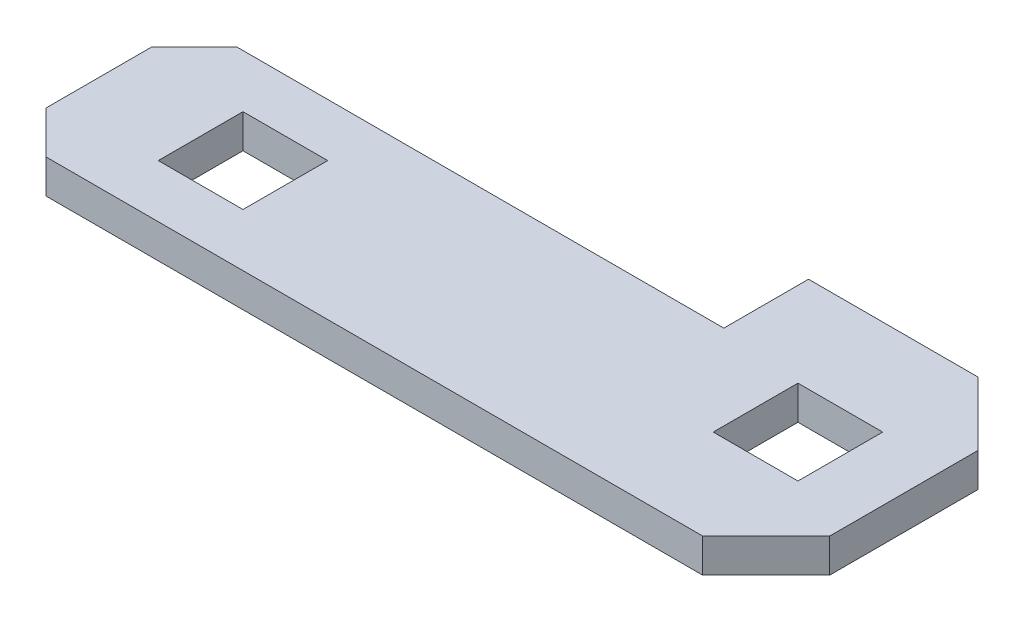
ISO-10303-21;
HEADER;
FILE_DESCRIPTION(('STEP AP214'),'2;1');
FILE_NAME('part.step','',(''),(''),'','','');
FILE_SCHEMA(('AUTOMOTIVE_DESIGN { 1 0 10303 214 1 1 1 1 }'));
ENDSEC;
DATA;
#1=APPLICATION_CONTEXT('core data for automotive mechanical design processes');
#2=APPLICATION_PROTOCOL_DEFINITION('international standard','automotive_design',2000,#1);
#3=PRODUCT_CONTEXT('',#1,'mechanical');
#4=PRODUCT('Part','Part','',(#3));
#5=PRODUCT_RELATED_PRODUCT_CATEGORY('part','',(#4));
#6=PRODUCT_DEFINITION_FORMATION('','',#4);
#7=PRODUCT_DEFINITION_CONTEXT('part definition',#1,'design');
#8=PRODUCT_DEFINITION('design','',#6,#7);
#9=PRODUCT_DEFINITION_SHAPE('','',#8);
#10=(LENGTH_UNIT() NAMED_UNIT(*) SI_UNIT(.MILLI.,.METRE.));
#11=(NAMED_UNIT(*) PLANE_ANGLE_UNIT() SI_UNIT($,.RADIAN.));
#12=(NAMED_UNIT(*) SI_UNIT($,.STERADIAN.) SOLID_ANGLE_UNIT());
#13=UNCERTAINTY_MEASURE_WITH_UNIT(LENGTH_MEASURE(1.E-05),#10,'distance_accuracy_value','');
#14=(GEOMETRIC_REPRESENTATION_CONTEXT(3) GLOBAL_UNCERTAINTY_ASSIGNED_CONTEXT((#13)) GLOBAL_UNIT_ASSIGNED_CONTEXT((#10,
#11,#12)) REPRESENTATION_CONTEXT('',''));
#15=CARTESIAN_POINT('',(0.,0.,0.));
#16=DIRECTION('',(0.,0.,1.));
#17=DIRECTION('',(1.,0.,0.));
#18=AXIS2_PLACEMENT_3D('',#15,#16,#17);
#19=CARTESIAN_POINT('',(18.,-0.8,0.));
#20=DIRECTION('',(0.,0.,1.));
#21=DIRECTION('',(1.,0.,0.));
#22=AXIS2_PLACEMENT_3D('',#19,#20,#21);
#23=PLANE('',#22);
#24=DIRECTION('',(1.,0.,0.));
#25=VECTOR('',#24,1.);
#26=CARTESIAN_POINT('',(18.,-0.8,0.));
#27=LINE('',#26,#25);
#28=CARTESIAN_POINT('',(1.,-0.8,0.));
#29=VERTEX_POINT('',#28);
#30=CARTESIAN_POINT('',(16.5,-0.8,0.));
#31=VERTEX_POINT('',#30);
#32=EDGE_CURVE('E240',#29,#31,#27,.T.);
#33=ORIENTED_EDGE('',*,*,#32,.T.);
#34=DIRECTION('',(0.,1.,0.));
#35=VECTOR('',#34,1.);
#36=CARTESIAN_POINT('',(16.5,-0.8,0.));
#37=LINE('',#36,#35);
#38=CARTESIAN_POINT('',(16.5,0.,0.));
#39=VERTEX_POINT('',#38);
#40=EDGE_CURVE('E11',#31,#39,#37,.T.);
#41=ORIENTED_EDGE('',*,*,#40,.T.);
#42=DIRECTION('',(1.,0.,0.));
#43=VECTOR('',#42,1.);
#44=CARTESIAN_POINT('',(18.,0.,0.));
#45=LINE('',#44,#43);
#46=CARTESIAN_POINT('',(1.,0.,0.));
#47=VERTEX_POINT('',#46);
#48=EDGE_CURVE('E233',#47,#39,#45,.T.);
#49=ORIENTED_EDGE('',*,*,#48,.F.);
#50=DIRECTION('',(0.,-1.,0.));
#51=VECTOR('',#50,1.);
#52=CARTESIAN_POINT('',(1.,-0.8,0.));
#53=LINE('',#52,#51);
#54=EDGE_CURVE('E293',#47,#29,#53,.T.);
#55=ORIENTED_EDGE('',*,*,#54,.T.);
#56=EDGE_LOOP('',(#33,#41,#49,#55));
#57=FACE_BOUND('',#56,.T.);
#58=ADVANCED_FACE('F36',(#57),#23,.T.);
#59=CARTESIAN_POINT('',(0.,-0.8,0.));
#60=DIRECTION('',(-1.,0.,0.));
#61=DIRECTION('',(0.,0.,1.));
#62=AXIS2_PLACEMENT_3D('',#59,#60,#61);
#63=PLANE('',#62);
#64=DIRECTION('',(0.,0.,1.));
#65=VECTOR('',#64,1.);
#66=CARTESIAN_POINT('',(0.,0.,0.));
#67=LINE('',#66,#65);
#68=CARTESIAN_POINT('',(0.,0.,-3.5));
#69=VERTEX_POINT('',#68);
#70=CARTESIAN_POINT('',(0.,0.,-0.999999999999997));
#71=VERTEX_POINT('',#70);
#72=EDGE_CURVE('E243',#69,#71,#67,.T.);
#73=ORIENTED_EDGE('',*,*,#72,.F.);
#74=DIRECTION('',(0.,-1.,0.));
#75=VECTOR('',#74,1.);
#76=CARTESIAN_POINT('',(0.,-0.8,-3.5));
#77=LINE('',#76,#75);
#78=CARTESIAN_POINT('',(0.,-0.8,-3.5));
#79=VERTEX_POINT('',#78);
#80=EDGE_CURVE('E287',#69,#79,#77,.T.);
#81=ORIENTED_EDGE('',*,*,#80,.T.);
#82=DIRECTION('',(0.,0.,1.));
#83=VECTOR('',#82,1.);
#84=CARTESIAN_POINT('',(0.,-0.8,0.));
#85=LINE('',#84,#83);
#86=CARTESIAN_POINT('',(0.,-0.8,-0.999999999999997));
#87=VERTEX_POINT('',#86);
#88=EDGE_CURVE('E254',#79,#87,#85,.T.);
#89=ORIENTED_EDGE('',*,*,#88,.T.);
#90=DIRECTION('',(0.,1.,0.));
#91=VECTOR('',#90,1.);
#92=CARTESIAN_POINT('',(0.,-0.8,-0.999999999999997));
#93=LINE('',#92,#91);
#94=EDGE_CURVE('E284',#87,#71,#93,.T.);
#95=ORIENTED_EDGE('',*,*,#94,.T.);
#96=EDGE_LOOP('',(#73,#81,#89,#95));
#97=FACE_BOUND('',#96,.T.);
#98=ADVANCED_FACE('F333',(#97),#63,.T.);
#99=CARTESIAN_POINT('',(0.,-0.8,-4.5));
#100=DIRECTION('',(0.,0.,-1.));
#101=DIRECTION('',(-1.,0.,0.));
#102=AXIS2_PLACEMENT_3D('',#99,#100,#101);
#103=PLANE('',#102);
#104=DIRECTION('',(-1.,0.,0.));
#105=VECTOR('',#104,1.);
#106=CARTESIAN_POINT('',(0.,-0.8,-4.5));
#107=LINE('',#106,#105);
#108=CARTESIAN_POINT('',(12.5,-0.8,-4.5));
#109=VERTEX_POINT('',#108);
#110=CARTESIAN_POINT('',(0.999999999999999,-0.8,-4.5));
#111=VERTEX_POINT('',#110);
#112=EDGE_CURVE('E251',#109,#111,#107,.T.);
#113=ORIENTED_EDGE('',*,*,#112,.T.);
#114=DIRECTION('',(0.,1.,0.));
#115=VECTOR('',#114,1.);
#116=CARTESIAN_POINT('',(0.999999999999999,-0.8,-4.5));
#117=LINE('',#116,#115);
#118=CARTESIAN_POINT('',(0.999999999999999,0.,-4.5));
#119=VERTEX_POINT('',#118);
#120=EDGE_CURVE('E275',#111,#119,#117,.T.);
#121=ORIENTED_EDGE('',*,*,#120,.T.);
#122=DIRECTION('',(-1.,0.,0.));
#123=VECTOR('',#122,1.);
#124=CARTESIAN_POINT('',(0.,0.,-4.5));
#125=LINE('',#124,#123);
#126=CARTESIAN_POINT('',(12.5,0.,-4.5));
#127=VERTEX_POINT('',#126);
#128=EDGE_CURVE('E268',#127,#119,#125,.T.);
#129=ORIENTED_EDGE('',*,*,#128,.F.);
#130=DIRECTION('',(0.,1.,0.));
#131=VECTOR('',#130,1.);
#132=CARTESIAN_POINT('',(12.5,-0.8,-4.5));
#133=LINE('',#132,#131);
#134=EDGE_CURVE('E273',#109,#127,#133,.T.);
#135=ORIENTED_EDGE('',*,*,#134,.F.);
#136=EDGE_LOOP('',(#113,#121,#129,#135));
#137=FACE_BOUND('',#136,.T.);
#138=ADVANCED_FACE('F324',(#137),#103,.T.);
#139=CARTESIAN_POINT('',(12.5,-0.8,-4.5));
#140=DIRECTION('',(-1.,0.,0.));
#141=DIRECTION('',(0.,0.,1.));
#142=AXIS2_PLACEMENT_3D('',#139,#140,#141);
#143=PLANE('',#142);
#144=DIRECTION('',(0.,0.,1.));
#145=VECTOR('',#144,1.);
#146=CARTESIAN_POINT('',(12.5,0.,-4.5));
#147=LINE('',#146,#145);
#148=CARTESIAN_POINT('',(12.5,0.,-6.5));
#149=VERTEX_POINT('',#148);
#150=EDGE_CURVE('E265',#149,#127,#147,.T.);
#151=ORIENTED_EDGE('',*,*,#150,.F.);
#152=DIRECTION('',(0.,1.,0.));
#153=VECTOR('',#152,1.);
#154=CARTESIAN_POINT('',(12.5,-0.8,-6.5));
#155=LINE('',#154,#153);
#156=CARTESIAN_POINT('',(12.5,-0.8,-6.5));
#157=VERTEX_POINT('',#156);
#158=EDGE_CURVE('E257',#157,#149,#155,.T.);
#159=ORIENTED_EDGE('',*,*,#158,.F.);
#160=DIRECTION('',(0.,0.,1.));
#161=VECTOR('',#160,1.);
#162=CARTESIAN_POINT('',(12.5,-0.8,-4.5));
#163=LINE('',#162,#161);
#164=EDGE_CURVE('E248',#157,#109,#163,.T.);
#165=ORIENTED_EDGE('',*,*,#164,.T.);
#166=ORIENTED_EDGE('',*,*,#134,.T.);
#167=EDGE_LOOP('',(#151,#159,#165,#166));
#168=FACE_BOUND('',#167,.T.);
#169=ADVANCED_FACE('F320',(#168),#143,.T.);
#170=CARTESIAN_POINT('',(12.5,-0.8,-6.5));
#171=DIRECTION('',(0.,0.,-1.));
#172=DIRECTION('',(-1.,0.,0.));
#173=AXIS2_PLACEMENT_3D('',#170,#171,#172);
#174=PLANE('',#173);
#175=DIRECTION('',(-1.,0.,0.));
#176=VECTOR('',#175,1.);
#177=CARTESIAN_POINT('',(12.5,0.,-6.5));
#178=LINE('',#177,#176);
#179=CARTESIAN_POINT('',(16.5,0.,-6.5));
#180=VERTEX_POINT('',#179);
#181=EDGE_CURVE('E263',#180,#149,#178,.T.);
#182=ORIENTED_EDGE('',*,*,#181,.F.);
#183=DIRECTION('',(0.,-1.,0.));
#184=VECTOR('',#183,1.);
#185=CARTESIAN_POINT('',(16.5,-0.8,-6.5));
#186=LINE('',#185,#184);
#187=CARTESIAN_POINT('',(16.5,-0.8,-6.5));
#188=VERTEX_POINT('',#187);
#189=EDGE_CURVE('E59',#180,#188,#186,.T.);
#190=ORIENTED_EDGE('',*,*,#189,.T.);
#191=DIRECTION('',(-1.,0.,0.));
#192=VECTOR('',#191,1.);
#193=CARTESIAN_POINT('',(12.5,-0.8,-6.5));
#194=LINE('',#193,#192);
#195=EDGE_CURVE('E246',#188,#157,#194,.T.);
#196=ORIENTED_EDGE('',*,*,#195,.T.);
#197=ORIENTED_EDGE('',*,*,#158,.T.);
#198=EDGE_LOOP('',(#182,#190,#196,#197));
#199=FACE_BOUND('',#198,.T.);
#200=ADVANCED_FACE('F316',(#199),#174,.T.);
#201=CARTESIAN_POINT('',(18.,-0.8,-6.5));
#202=DIRECTION('',(1.,0.,0.));
#203=DIRECTION('',(0.,0.,-1.));
#204=AXIS2_PLACEMENT_3D('',#201,#202,#203);
#205=PLANE('',#204);
#206=DIRECTION('',(0.,0.,-1.));
#207=VECTOR('',#206,1.);
#208=CARTESIAN_POINT('',(18.,-0.8,-6.5));
#209=LINE('',#208,#207);
#210=CARTESIAN_POINT('',(18.,-0.8,-1.5));
#211=VERTEX_POINT('',#210);
#212=CARTESIAN_POINT('',(18.,-0.8,-5.));
#213=VERTEX_POINT('',#212);
#214=EDGE_CURVE('E242',#211,#213,#209,.T.);
#215=ORIENTED_EDGE('',*,*,#214,.T.);
#216=DIRECTION('',(0.,1.,0.));
#217=VECTOR('',#216,1.);
#218=CARTESIAN_POINT('',(18.,-0.8,-5.));
#219=LINE('',#218,#217);
#220=CARTESIAN_POINT('',(18.,0.,-5.));
#221=VERTEX_POINT('',#220);
#222=EDGE_CURVE('E297',#213,#221,#219,.T.);
#223=ORIENTED_EDGE('',*,*,#222,.T.);
#224=DIRECTION('',(0.,0.,-1.));
#225=VECTOR('',#224,1.);
#226=CARTESIAN_POINT('',(18.,0.,-6.5));
#227=LINE('',#226,#225);
#228=CARTESIAN_POINT('',(18.,0.,-1.5));
#229=VERTEX_POINT('',#228);
#230=EDGE_CURVE('E260',#229,#221,#227,.T.);
#231=ORIENTED_EDGE('',*,*,#230,.F.);
#232=DIRECTION('',(0.,-1.,0.));
#233=VECTOR('',#232,1.);
#234=CARTESIAN_POINT('',(18.,-0.8,-1.5));
#235=LINE('',#234,#233);
#236=EDGE_CURVE('E295',#229,#211,#235,.T.);
#237=ORIENTED_EDGE('',*,*,#236,.T.);
#238=EDGE_LOOP('',(#215,#223,#231,#237));
#239=FACE_BOUND('',#238,.T.);
#240=ADVANCED_FACE('F310',(#239),#205,.T.);
#241=CARTESIAN_POINT('',(0.,-0.8,0.));
#242=DIRECTION('',(0.,-1.,0.));
#243=DIRECTION('',(0.,0.,-1.));
#244=AXIS2_PLACEMENT_3D('',#241,#242,#243);
#245=PLANE('',#244);
#246=DIRECTION('',(0.,0.,-1.));
#247=VECTOR('',#246,1.);
#248=CARTESIAN_POINT('',(16.5,-0.8,-2.25));
#249=LINE('',#248,#247);
#250=CARTESIAN_POINT('',(16.5,-0.8,-2.25));
#251=VERTEX_POINT('',#250);
#252=CARTESIAN_POINT('',(16.5,-0.8,-4.25));
#253=VERTEX_POINT('',#252);
#254=EDGE_CURVE('E168',#251,#253,#249,.T.);
#255=ORIENTED_EDGE('',*,*,#254,.T.);
#256=DIRECTION('',(-1.,0.,0.));
#257=VECTOR('',#256,1.);
#258=CARTESIAN_POINT('',(14.5,-0.8,-4.25));
#259=LINE('',#258,#257);
#260=CARTESIAN_POINT('',(14.5,-0.8,-4.25));
#261=VERTEX_POINT('',#260);
#262=EDGE_CURVE('E180',#253,#261,#259,.T.);
#263=ORIENTED_EDGE('',*,*,#262,.T.);
#264=DIRECTION('',(0.,0.,1.));
#265=VECTOR('',#264,1.);
#266=CARTESIAN_POINT('',(14.5,-0.8,-2.25));
#267=LINE('',#266,#265);
#268=CARTESIAN_POINT('',(14.5,-0.8,-2.25));
#269=VERTEX_POINT('',#268);
#270=EDGE_CURVE('E184',#261,#269,#267,.T.);
#271=ORIENTED_EDGE('',*,*,#270,.T.);
#272=DIRECTION('',(1.,0.,0.));
#273=VECTOR('',#272,1.);
#274=CARTESIAN_POINT('',(14.5,-0.8,-2.25));
#275=LINE('',#274,#273);
#276=EDGE_CURVE('E176',#269,#251,#275,.T.);
#277=ORIENTED_EDGE('',*,*,#276,.T.);
#278=EDGE_LOOP('',(#255,#263,#271,#277));
#279=FACE_BOUND('',#278,.T.);
#280=DIRECTION('',(0.,0.,-1.));
#281=VECTOR('',#280,1.);
#282=CARTESIAN_POINT('',(4.4,-0.8,-1.25));
#283=LINE('',#282,#281);
#284=CARTESIAN_POINT('',(4.4,-0.8,-1.25));
#285=VERTEX_POINT('',#284);
#286=CARTESIAN_POINT('',(4.4,-0.8,-3.25));
#287=VERTEX_POINT('',#286);
#288=EDGE_CURVE('E208',#285,#287,#283,.T.);
#289=ORIENTED_EDGE('',*,*,#288,.T.);
#290=DIRECTION('',(-1.,0.,0.));
#291=VECTOR('',#290,1.);
#292=CARTESIAN_POINT('',(2.4,-0.8,-3.25));
#293=LINE('',#292,#291);
#294=CARTESIAN_POINT('',(2.4,-0.8,-3.25));
#295=VERTEX_POINT('',#294);
#296=EDGE_CURVE('E211',#287,#295,#293,.T.);
#297=ORIENTED_EDGE('',*,*,#296,.T.);
#298=DIRECTION('',(0.,0.,1.));
#299=VECTOR('',#298,1.);
#300=CARTESIAN_POINT('',(2.4,-0.8,-1.25));
#301=LINE('',#300,#299);
#302=CARTESIAN_POINT('',(2.4,-0.8,-1.25));
#303=VERTEX_POINT('',#302);
#304=EDGE_CURVE('E215',#295,#303,#301,.T.);
#305=ORIENTED_EDGE('',*,*,#304,.T.);
#306=DIRECTION('',(1.,0.,0.));
#307=VECTOR('',#306,1.);
#308=CARTESIAN_POINT('',(2.4,-0.8,-1.25));
#309=LINE('',#308,#307);
#310=EDGE_CURVE('E218',#303,#285,#309,.T.);
#311=ORIENTED_EDGE('',*,*,#310,.T.);
#312=EDGE_LOOP('',(#289,#297,#305,#311));
#313=FACE_BOUND('',#312,.T.);
#314=ORIENTED_EDGE('',*,*,#195,.F.);
#315=DIRECTION('',(-0.707106781186549,0.,-0.707106781186546));
#316=VECTOR('',#315,1.);
#317=CARTESIAN_POINT('',(11.5,-0.8,-11.5));
#318=LINE('',#317,#316);
#319=EDGE_CURVE('E44',#188,#213,#318,.F.);
#320=ORIENTED_EDGE('',*,*,#319,.T.);
#321=ORIENTED_EDGE('',*,*,#214,.F.);
#322=DIRECTION('',(0.707106781186545,0.,-0.70710678118655));
#323=VECTOR('',#322,1.);
#324=CARTESIAN_POINT('',(8.25000000000006,-0.8,8.25000000000001));
#325=LINE('',#324,#323);
#326=EDGE_CURVE('E51',#211,#31,#325,.F.);
#327=ORIENTED_EDGE('',*,*,#326,.T.);
#328=ORIENTED_EDGE('',*,*,#32,.F.);
#329=DIRECTION('',(0.707106781186549,0.,0.707106781186546));
#330=VECTOR('',#329,1.);
#331=CARTESIAN_POINT('',(0.499999999999999,-0.8,-0.500000000000001));
#332=LINE('',#331,#330);
#333=EDGE_CURVE('E289',#29,#87,#332,.F.);
#334=ORIENTED_EDGE('',*,*,#333,.T.);
#335=ORIENTED_EDGE('',*,*,#88,.F.);
#336=DIRECTION('',(-0.707106781186546,0.,0.707106781186549));
#337=VECTOR('',#336,1.);
#338=CARTESIAN_POINT('',(-1.75,-0.8,-1.74999999999999));
#339=LINE('',#338,#337);
#340=EDGE_CURVE('E291',#79,#111,#339,.F.);
#341=ORIENTED_EDGE('',*,*,#340,.T.);
#342=ORIENTED_EDGE('',*,*,#112,.F.);
#343=ORIENTED_EDGE('',*,*,#164,.F.);
#344=EDGE_LOOP('',(#314,#320,#321,#327,#328,#334,#335,#341,#342,#343));
#345=FACE_BOUND('',#344,.T.);
#346=ADVANCED_FACE('F186',(#279,#313,#345),#245,.T.);
#347=CARTESIAN_POINT('',(0.,0.,0.));
#348=DIRECTION('',(0.,-1.,0.));
#349=DIRECTION('',(0.,0.,-1.));
#350=AXIS2_PLACEMENT_3D('',#347,#348,#349);
#351=PLANE('',#350);
#352=DIRECTION('',(-1.,0.,0.));
#353=VECTOR('',#352,1.);
#354=CARTESIAN_POINT('',(14.5,0.,-4.25));
#355=LINE('',#354,#353);
#356=CARTESIAN_POINT('',(16.5,0.,-4.25));
#357=VERTEX_POINT('',#356);
#358=CARTESIAN_POINT('',(14.5,0.,-4.25));
#359=VERTEX_POINT('',#358);
#360=EDGE_CURVE('E198',#357,#359,#355,.T.);
#361=ORIENTED_EDGE('',*,*,#360,.F.);
#362=DIRECTION('',(0.,0.,-1.));
#363=VECTOR('',#362,1.);
#364=CARTESIAN_POINT('',(16.5,0.,-2.25));
#365=LINE('',#364,#363);
#366=CARTESIAN_POINT('',(16.5,0.,-2.25));
#367=VERTEX_POINT('',#366);
#368=EDGE_CURVE('E171',#367,#357,#365,.T.);
#369=ORIENTED_EDGE('',*,*,#368,.F.);
#370=DIRECTION('',(1.,0.,0.));
#371=VECTOR('',#370,1.);
#372=CARTESIAN_POINT('',(14.5,0.,-2.25));
#373=LINE('',#372,#371);
#374=CARTESIAN_POINT('',(14.5,0.,-2.25));
#375=VERTEX_POINT('',#374);
#376=EDGE_CURVE('E189',#375,#367,#373,.T.);
#377=ORIENTED_EDGE('',*,*,#376,.F.);
#378=DIRECTION('',(0.,0.,1.));
#379=VECTOR('',#378,1.);
#380=CARTESIAN_POINT('',(14.5,0.,-2.25));
#381=LINE('',#380,#379);
#382=EDGE_CURVE('E192',#359,#375,#381,.T.);
#383=ORIENTED_EDGE('',*,*,#382,.F.);
#384=EDGE_LOOP('',(#361,#369,#377,#383));
#385=FACE_BOUND('',#384,.T.);
#386=DIRECTION('',(-1.,0.,0.));
#387=VECTOR('',#386,1.);
#388=CARTESIAN_POINT('',(2.4,0.,-3.25));
#389=LINE('',#388,#387);
#390=CARTESIAN_POINT('',(4.4,0.,-3.25));
#391=VERTEX_POINT('',#390);
#392=CARTESIAN_POINT('',(2.4,0.,-3.25));
#393=VERTEX_POINT('',#392);
#394=EDGE_CURVE('E223',#391,#393,#389,.T.);
#395=ORIENTED_EDGE('',*,*,#394,.F.);
#396=DIRECTION('',(0.,0.,-1.));
#397=VECTOR('',#396,1.);
#398=CARTESIAN_POINT('',(4.4,0.,-1.25));
#399=LINE('',#398,#397);
#400=CARTESIAN_POINT('',(4.4,0.,-1.25));
#401=VERTEX_POINT('',#400);
#402=EDGE_CURVE('E204',#401,#391,#399,.T.);
#403=ORIENTED_EDGE('',*,*,#402,.F.);
#404=DIRECTION('',(1.,0.,0.));
#405=VECTOR('',#404,1.);
#406=CARTESIAN_POINT('',(2.4,0.,-1.25));
#407=LINE('',#406,#405);
#408=CARTESIAN_POINT('',(2.4,0.,-1.25));
#409=VERTEX_POINT('',#408);
#410=EDGE_CURVE('E212',#409,#401,#407,.T.);
#411=ORIENTED_EDGE('',*,*,#410,.F.);
#412=DIRECTION('',(0.,0.,1.));
#413=VECTOR('',#412,1.);
#414=CARTESIAN_POINT('',(2.4,0.,-1.25));
#415=LINE('',#414,#413);
#416=EDGE_CURVE('E226',#393,#409,#415,.T.);
#417=ORIENTED_EDGE('',*,*,#416,.F.);
#418=EDGE_LOOP('',(#395,#403,#411,#417));
#419=FACE_BOUND('',#418,.T.);
#420=ORIENTED_EDGE('',*,*,#230,.T.);
#421=DIRECTION('',(0.707106781186549,0.,0.707106781186546));
#422=VECTOR('',#421,1.);
#423=CARTESIAN_POINT('',(18.,0.,-5.));
#424=LINE('',#423,#422);
#425=EDGE_CURVE('E302',#221,#180,#424,.F.);
#426=ORIENTED_EDGE('',*,*,#425,.T.);
#427=ORIENTED_EDGE('',*,*,#181,.T.);
#428=ORIENTED_EDGE('',*,*,#150,.T.);
#429=ORIENTED_EDGE('',*,*,#128,.T.);
#430=DIRECTION('',(0.707106781186546,0.,-0.707106781186549));
#431=VECTOR('',#430,1.);
#432=CARTESIAN_POINT('',(0.999999999999999,0.,-4.5));
#433=LINE('',#432,#431);
#434=EDGE_CURVE('E282',#119,#69,#433,.F.);
#435=ORIENTED_EDGE('',*,*,#434,.T.);
#436=ORIENTED_EDGE('',*,*,#72,.T.);
#437=DIRECTION('',(-0.707106781186549,0.,-0.707106781186546));
#438=VECTOR('',#437,1.);
#439=CARTESIAN_POINT('',(0.,0.,-0.999999999999997));
#440=LINE('',#439,#438);
#441=EDGE_CURVE('E280',#71,#47,#440,.F.);
#442=ORIENTED_EDGE('',*,*,#441,.T.);
#443=ORIENTED_EDGE('',*,*,#48,.T.);
#444=DIRECTION('',(-0.707106781186545,0.,0.70710678118655));
#445=VECTOR('',#444,1.);
#446=CARTESIAN_POINT('',(16.5,0.,0.));
#447=LINE('',#446,#445);
#448=EDGE_CURVE('E300',#39,#229,#447,.F.);
#449=ORIENTED_EDGE('',*,*,#448,.T.);
#450=EDGE_LOOP('',(#420,#426,#427,#428,#429,#435,#436,#442,#443,#449));
#451=FACE_BOUND('',#450,.T.);
#452=ADVANCED_FACE('F315',(#385,#419,#451),#351,.F.);
#453=CARTESIAN_POINT('',(4.4,-0.8,-1.25));
#454=DIRECTION('',(1.,0.,0.));
#455=DIRECTION('',(0.,0.,-1.));
#456=AXIS2_PLACEMENT_3D('',#453,#454,#455);
#457=PLANE('',#456);
#458=ORIENTED_EDGE('',*,*,#402,.T.);
#459=DIRECTION('',(0.,1.,0.));
#460=VECTOR('',#459,1.);
#461=CARTESIAN_POINT('',(4.4,-0.8,-3.25));
#462=LINE('',#461,#460);
#463=EDGE_CURVE('E221',#287,#391,#462,.T.);
#464=ORIENTED_EDGE('',*,*,#463,.F.);
#465=ORIENTED_EDGE('',*,*,#288,.F.);
#466=DIRECTION('',(0.,1.,0.));
#467=VECTOR('',#466,1.);
#468=CARTESIAN_POINT('',(4.4,-0.8,-1.25));
#469=LINE('',#468,#467);
#470=EDGE_CURVE('E231',#285,#401,#469,.T.);
#471=ORIENTED_EDGE('',*,*,#470,.T.);
#472=EDGE_LOOP('',(#458,#464,#465,#471));
#473=FACE_BOUND('',#472,.T.);
#474=ADVANCED_FACE('F381',(#473),#457,.F.);
#475=CARTESIAN_POINT('',(2.4,-0.8,-1.25));
#476=DIRECTION('',(0.,0.,1.));
#477=DIRECTION('',(1.,0.,0.));
#478=AXIS2_PLACEMENT_3D('',#475,#476,#477);
#479=PLANE('',#478);
#480=ORIENTED_EDGE('',*,*,#410,.T.);
#481=ORIENTED_EDGE('',*,*,#470,.F.);
#482=ORIENTED_EDGE('',*,*,#310,.F.);
#483=DIRECTION('',(0.,1.,0.));
#484=VECTOR('',#483,1.);
#485=CARTESIAN_POINT('',(2.4,-0.8,-1.25));
#486=LINE('',#485,#484);
#487=EDGE_CURVE('E234',#303,#409,#486,.T.);
#488=ORIENTED_EDGE('',*,*,#487,.T.);
#489=EDGE_LOOP('',(#480,#481,#482,#488));
#490=FACE_BOUND('',#489,.T.);
#491=ADVANCED_FACE('F450',(#490),#479,.F.);
#492=CARTESIAN_POINT('',(2.4,-0.8,-1.25));
#493=DIRECTION('',(-1.,0.,0.));
#494=DIRECTION('',(0.,0.,1.));
#495=AXIS2_PLACEMENT_3D('',#492,#493,#494);
#496=PLANE('',#495);
#497=ORIENTED_EDGE('',*,*,#416,.T.);
#498=ORIENTED_EDGE('',*,*,#487,.F.);
#499=ORIENTED_EDGE('',*,*,#304,.F.);
#500=DIRECTION('',(0.,1.,0.));
#501=VECTOR('',#500,1.);
#502=CARTESIAN_POINT('',(2.4,-0.8,-3.25));
#503=LINE('',#502,#501);
#504=EDGE_CURVE('E236',#295,#393,#503,.T.);
#505=ORIENTED_EDGE('',*,*,#504,.T.);
#506=EDGE_LOOP('',(#497,#498,#499,#505));
#507=FACE_BOUND('',#506,.T.);
#508=ADVANCED_FACE('F461',(#507),#496,.F.);
#509=CARTESIAN_POINT('',(2.4,-0.8,-3.25));
#510=DIRECTION('',(0.,0.,-1.));
#511=DIRECTION('',(-1.,0.,0.));
#512=AXIS2_PLACEMENT_3D('',#509,#510,#511);
#513=PLANE('',#512);
#514=ORIENTED_EDGE('',*,*,#394,.T.);
#515=ORIENTED_EDGE('',*,*,#504,.F.);
#516=ORIENTED_EDGE('',*,*,#296,.F.);
#517=ORIENTED_EDGE('',*,*,#463,.T.);
#518=EDGE_LOOP('',(#514,#515,#516,#517));
#519=FACE_BOUND('',#518,.T.);
#520=ADVANCED_FACE('F472',(#519),#513,.F.);
#521=CARTESIAN_POINT('',(16.5,-0.8,-2.25));
#522=DIRECTION('',(1.,0.,0.));
#523=DIRECTION('',(0.,0.,-1.));
#524=AXIS2_PLACEMENT_3D('',#521,#522,#523);
#525=PLANE('',#524);
#526=ORIENTED_EDGE('',*,*,#368,.T.);
#527=DIRECTION('',(0.,1.,0.));
#528=VECTOR('',#527,1.);
#529=CARTESIAN_POINT('',(16.5,-0.8,-4.25));
#530=LINE('',#529,#528);
#531=EDGE_CURVE('E164',#253,#357,#530,.T.);
#532=ORIENTED_EDGE('',*,*,#531,.F.);
#533=ORIENTED_EDGE('',*,*,#254,.F.);
#534=DIRECTION('',(0.,1.,0.));
#535=VECTOR('',#534,1.);
#536=CARTESIAN_POINT('',(16.5,-0.8,-2.25));
#537=LINE('',#536,#535);
#538=EDGE_CURVE('E202',#251,#367,#537,.T.);
#539=ORIENTED_EDGE('',*,*,#538,.T.);
#540=EDGE_LOOP('',(#526,#532,#533,#539));
#541=FACE_BOUND('',#540,.T.);
#542=ADVANCED_FACE('F166',(#541),#525,.F.);
#543=CARTESIAN_POINT('',(14.5,-0.8,-2.25));
#544=DIRECTION('',(0.,0.,1.));
#545=DIRECTION('',(1.,0.,0.));
#546=AXIS2_PLACEMENT_3D('',#543,#544,#545);
#547=PLANE('',#546);
#548=ORIENTED_EDGE('',*,*,#376,.T.);
#549=ORIENTED_EDGE('',*,*,#538,.F.);
#550=ORIENTED_EDGE('',*,*,#276,.F.);
#551=DIRECTION('',(0.,1.,0.));
#552=VECTOR('',#551,1.);
#553=CARTESIAN_POINT('',(14.5,-0.8,-2.25));
#554=LINE('',#553,#552);
#555=EDGE_CURVE('E205',#269,#375,#554,.T.);
#556=ORIENTED_EDGE('',*,*,#555,.T.);
#557=EDGE_LOOP('',(#548,#549,#550,#556));
#558=FACE_BOUND('',#557,.T.);
#559=ADVANCED_FACE('F493',(#558),#547,.F.);
#560=CARTESIAN_POINT('',(14.5,-0.8,-2.25));
#561=DIRECTION('',(-1.,0.,0.));
#562=DIRECTION('',(0.,0.,1.));
#563=AXIS2_PLACEMENT_3D('',#560,#561,#562);
#564=PLANE('',#563);
#565=ORIENTED_EDGE('',*,*,#382,.T.);
#566=ORIENTED_EDGE('',*,*,#555,.F.);
#567=ORIENTED_EDGE('',*,*,#270,.F.);
#568=DIRECTION('',(0.,1.,0.));
#569=VECTOR('',#568,1.);
#570=CARTESIAN_POINT('',(14.5,-0.8,-4.25));
#571=LINE('',#570,#569);
#572=EDGE_CURVE('E175',#261,#359,#571,.T.);
#573=ORIENTED_EDGE('',*,*,#572,.T.);
#574=EDGE_LOOP('',(#565,#566,#567,#573));
#575=FACE_BOUND('',#574,.T.);
#576=ADVANCED_FACE('F503',(#575),#564,.F.);
#577=CARTESIAN_POINT('',(14.5,-0.8,-4.25));
#578=DIRECTION('',(0.,0.,-1.));
#579=DIRECTION('',(-1.,0.,0.));
#580=AXIS2_PLACEMENT_3D('',#577,#578,#579);
#581=PLANE('',#580);
#582=ORIENTED_EDGE('',*,*,#360,.T.);
#583=ORIENTED_EDGE('',*,*,#572,.F.);
#584=ORIENTED_EDGE('',*,*,#262,.F.);
#585=ORIENTED_EDGE('',*,*,#531,.T.);
#586=EDGE_LOOP('',(#582,#583,#584,#585));
#587=FACE_BOUND('',#586,.T.);
#588=ADVANCED_FACE('F181',(#587),#581,.F.);
#589=CARTESIAN_POINT('',(0.999999999999999,-0.8,-4.5));
#590=DIRECTION('',(0.707106781186549,0.,0.707106781186546));
#591=DIRECTION('',(0.,1.,0.));
#592=AXIS2_PLACEMENT_3D('',#589,#590,#591);
#593=PLANE('',#592);
#594=ORIENTED_EDGE('',*,*,#340,.F.);
#595=ORIENTED_EDGE('',*,*,#80,.F.);
#596=ORIENTED_EDGE('',*,*,#434,.F.);
#597=ORIENTED_EDGE('',*,*,#120,.F.);
#598=EDGE_LOOP('',(#594,#595,#596,#597));
#599=FACE_BOUND('',#598,.T.);
#600=ADVANCED_FACE('F329',(#599),#593,.F.);
#601=CARTESIAN_POINT('',(0.,-0.8,-0.999999999999997));
#602=DIRECTION('',(0.707106781186546,0.,-0.707106781186549));
#603=DIRECTION('',(0.,1.,0.));
#604=AXIS2_PLACEMENT_3D('',#601,#602,#603);
#605=PLANE('',#604);
#606=ORIENTED_EDGE('',*,*,#333,.F.);
#607=ORIENTED_EDGE('',*,*,#54,.F.);
#608=ORIENTED_EDGE('',*,*,#441,.F.);
#609=ORIENTED_EDGE('',*,*,#94,.F.);
#610=EDGE_LOOP('',(#606,#607,#608,#609));
#611=FACE_BOUND('',#610,.T.);
#612=ADVANCED_FACE('F338',(#611),#605,.F.);
#613=CARTESIAN_POINT('',(18.,-0.8,-5.));
#614=DIRECTION('',(-0.707106781186546,0.,0.707106781186549));
#615=DIRECTION('',(0.,1.,0.));
#616=AXIS2_PLACEMENT_3D('',#613,#614,#615);
#617=PLANE('',#616);
#618=ORIENTED_EDGE('',*,*,#319,.F.);
#619=ORIENTED_EDGE('',*,*,#189,.F.);
#620=ORIENTED_EDGE('',*,*,#425,.F.);
#621=ORIENTED_EDGE('',*,*,#222,.F.);
#622=EDGE_LOOP('',(#618,#619,#620,#621));
#623=FACE_BOUND('',#622,.T.);
#624=ADVANCED_FACE('F313',(#623),#617,.F.);
#625=CARTESIAN_POINT('',(16.5,-0.8,0.));
#626=DIRECTION('',(-0.70710678118655,0.,-0.707106781186545));
#627=DIRECTION('',(0.,1.,0.));
#628=AXIS2_PLACEMENT_3D('',#625,#626,#627);
#629=PLANE('',#628);
#630=ORIENTED_EDGE('',*,*,#326,.F.);
#631=ORIENTED_EDGE('',*,*,#236,.F.);
#632=ORIENTED_EDGE('',*,*,#448,.F.);
#633=ORIENTED_EDGE('',*,*,#40,.F.);
#634=EDGE_LOOP('',(#630,#631,#632,#633));
#635=FACE_BOUND('',#634,.T.);
#636=ADVANCED_FACE('F38',(#635),#629,.F.);
#637=CLOSED_SHELL('',(#58,#98,#138,#169,#200,#240,#346,#452,#474,#491,#508,#520,#542,#559,#576,
#588,#600,#612,#624,#636));
#638=MANIFOLD_SOLID_BREP('B2',#637);
#639=ADVANCED_BREP_SHAPE_REPRESENTATION('',(#18,#638),#14);
#640=SHAPE_DEFINITION_REPRESENTATION(#9,#639);
ENDSEC;
END-ISO-10303-21;
